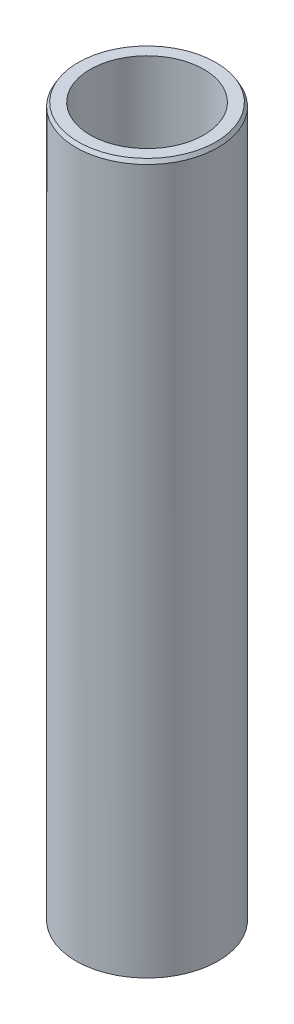
ISO-10303-21;
HEADER;
FILE_DESCRIPTION(('STEP AP214'),'2;1');
FILE_NAME('part.step','',(''),(''),'','','');
FILE_SCHEMA(('AUTOMOTIVE_DESIGN { 1 0 10303 214 1 1 1 1 }'));
ENDSEC;
DATA;
#1=APPLICATION_CONTEXT('core data for automotive mechanical design processes');
#2=APPLICATION_PROTOCOL_DEFINITION('international standard','automotive_design',2000,#1);
#3=PRODUCT_CONTEXT('',#1,'mechanical');
#4=PRODUCT('Part','Part','',(#3));
#5=PRODUCT_RELATED_PRODUCT_CATEGORY('part','',(#4));
#6=PRODUCT_DEFINITION_FORMATION('','',#4);
#7=PRODUCT_DEFINITION_CONTEXT('part definition',#1,'design');
#8=PRODUCT_DEFINITION('design','',#6,#7);
#9=PRODUCT_DEFINITION_SHAPE('','',#8);
#10=(LENGTH_UNIT() NAMED_UNIT(*) SI_UNIT(.MILLI.,.METRE.));
#11=(NAMED_UNIT(*) PLANE_ANGLE_UNIT() SI_UNIT($,.RADIAN.));
#12=(NAMED_UNIT(*) SI_UNIT($,.STERADIAN.) SOLID_ANGLE_UNIT());
#13=UNCERTAINTY_MEASURE_WITH_UNIT(LENGTH_MEASURE(1.E-05),#10,'distance_accuracy_value','');
#14=(GEOMETRIC_REPRESENTATION_CONTEXT(3) GLOBAL_UNCERTAINTY_ASSIGNED_CONTEXT((#13)) GLOBAL_UNIT_ASSIGNED_CONTEXT((#10,
#11,#12)) REPRESENTATION_CONTEXT('',''));
#15=CARTESIAN_POINT('',(0.,0.,0.));
#16=DIRECTION('',(0.,0.,1.));
#17=DIRECTION('',(1.,0.,0.));
#18=AXIS2_PLACEMENT_3D('',#15,#16,#17);
#19=CARTESIAN_POINT('',(0.,600.,0.));
#20=DIRECTION('',(0.,-1.,0.));
#21=DIRECTION('',(0.,0.,-1.));
#22=AXIS2_PLACEMENT_3D('',#19,#20,#21);
#23=CYLINDRICAL_SURFACE('',#22,60.);
#24=CARTESIAN_POINT('',(0.,596.803561940053,0.));
#25=DIRECTION('',(0.,1.,0.));
#26=DIRECTION('',(0.,0.,1.));
#27=AXIS2_PLACEMENT_3D('',#24,#25,#26);
#28=CIRCLE('',#27,60.);
#29=CARTESIAN_POINT('',(0.,596.803561940053,-60.));
#30=VERTEX_POINT('',#29);
#31=EDGE_CURVE('E50',#30,#30,#28,.F.);
#32=CARTESIAN_POINT('',(0.,1.84546437435817,0.));
#33=DIRECTION('',(0.,1.,0.));
#34=DIRECTION('',(0.,0.,1.));
#35=AXIS2_PLACEMENT_3D('',#32,#33,#34);
#36=CIRCLE('',#35,60.);
#37=CARTESIAN_POINT('',(0.,1.84546437435806,-60.));
#38=VERTEX_POINT('',#37);
#39=EDGE_CURVE('E51',#38,#38,#36,.T.);
#40=CARTESIAN_POINT('',(0.,596.803561940053,-60.));
#41=CARTESIAN_POINT('',(0.,590.606081757077,-60.));
#42=CARTESIAN_POINT('',(0.,584.408601574101,-60.));
#43=CARTESIAN_POINT('',(0.,572.013641208149,-60.));
#44=CARTESIAN_POINT('',(0.,565.816161025173,-60.));
#45=CARTESIAN_POINT('',(0.,553.421200659221,-60.));
#46=CARTESIAN_POINT('',(0.,547.223720476245,-60.));
#47=CARTESIAN_POINT('',(0.,534.828760110293,-60.));
#48=CARTESIAN_POINT('',(0.,528.631279927317,-60.));
#49=CARTESIAN_POINT('',(0.,516.236319561365,-60.));
#50=CARTESIAN_POINT('',(0.,510.038839378389,-60.));
#51=CARTESIAN_POINT('',(0.,497.643879012437,-60.));
#52=CARTESIAN_POINT('',(0.,491.446398829461,-60.));
#53=CARTESIAN_POINT('',(0.,479.051438463509,-60.));
#54=CARTESIAN_POINT('',(0.,472.853958280533,-60.));
#55=CARTESIAN_POINT('',(0.,460.458997914581,-60.));
#56=CARTESIAN_POINT('',(0.,454.261517731605,-60.));
#57=CARTESIAN_POINT('',(0.,441.866557365653,-60.));
#58=CARTESIAN_POINT('',(0.,435.669077182677,-60.));
#59=CARTESIAN_POINT('',(0.,423.274116816725,-60.));
#60=CARTESIAN_POINT('',(0.,417.076636633749,-60.));
#61=CARTESIAN_POINT('',(0.,404.681676267797,-60.));
#62=CARTESIAN_POINT('',(0.,398.484196084822,-60.));
#63=CARTESIAN_POINT('',(0.,386.089235718869,-60.));
#64=CARTESIAN_POINT('',(0.,379.891755535893,-60.));
#65=CARTESIAN_POINT('',(0.,367.496795169941,-60.));
#66=CARTESIAN_POINT('',(0.,361.299314986965,-60.));
#67=CARTESIAN_POINT('',(0.,348.904354621014,-60.));
#68=CARTESIAN_POINT('',(0.,342.706874438038,-60.));
#69=CARTESIAN_POINT('',(0.,330.311914072086,-60.));
#70=CARTESIAN_POINT('',(0.,324.11443388911,-60.));
#71=CARTESIAN_POINT('',(0.,311.719473523158,-60.));
#72=CARTESIAN_POINT('',(0.,305.521993340182,-60.));
#73=CARTESIAN_POINT('',(0.,293.12703297423,-60.));
#74=CARTESIAN_POINT('',(0.,286.929552791254,-60.));
#75=CARTESIAN_POINT('',(0.,274.534592425302,-60.));
#76=CARTESIAN_POINT('',(0.,268.337112242326,-60.));
#77=CARTESIAN_POINT('',(0.,255.942151876374,-60.));
#78=CARTESIAN_POINT('',(0.,249.744671693398,-60.));
#79=CARTESIAN_POINT('',(0.,237.349711327446,-60.));
#80=CARTESIAN_POINT('',(0.,231.15223114447,-60.));
#81=CARTESIAN_POINT('',(0.,218.757270778518,-60.));
#82=CARTESIAN_POINT('',(0.,212.559790595542,-60.));
#83=CARTESIAN_POINT('',(0.,200.16483022959,-60.));
#84=CARTESIAN_POINT('',(0.,193.967350046614,-60.));
#85=CARTESIAN_POINT('',(0.,181.572389680662,-60.));
#86=CARTESIAN_POINT('',(0.,175.374909497686,-60.));
#87=CARTESIAN_POINT('',(0.,162.979949131734,-60.));
#88=CARTESIAN_POINT('',(0.,156.782468948758,-60.));
#89=CARTESIAN_POINT('',(0.,144.387508582806,-60.));
#90=CARTESIAN_POINT('',(0.,138.19002839983,-60.));
#91=CARTESIAN_POINT('',(0.,125.795068033878,-60.));
#92=CARTESIAN_POINT('',(0.,119.597587850902,-60.));
#93=CARTESIAN_POINT('',(0.,107.20262748495,-60.));
#94=CARTESIAN_POINT('',(0.,101.005147301974,-60.));
#95=CARTESIAN_POINT('',(0.,88.6101869360218,-60.));
#96=CARTESIAN_POINT('',(0.,82.4127067530458,-60.));
#97=CARTESIAN_POINT('',(0.,70.0177463870939,-60.));
#98=CARTESIAN_POINT('',(0.,63.8202662041179,-60.));
#99=CARTESIAN_POINT('',(0.,51.4253058381659,-60.));
#100=CARTESIAN_POINT('',(0.,45.2278256551899,-60.));
#101=CARTESIAN_POINT('',(0.,32.832865289238,-60.));
#102=CARTESIAN_POINT('',(0.,26.635385106262,-60.));
#103=CARTESIAN_POINT('',(0.,14.24042474031,-60.));
#104=CARTESIAN_POINT('',(0.,8.04294455733404,-60.));
#105=CARTESIAN_POINT('',(0.,1.84546437435806,-60.));
#106=B_SPLINE_CURVE_WITH_KNOTS('',3,(#40,#41,#42,#43,#44,#45,#46,#47,#48,#49,#50,#51,#52,#53,
#54,#55,#56,#57,#58,#59,#60,#61,#62,#63,#64,#65,#66,#67,#68,#69,#70,#71,#72,#73,#74,#75,#76,#77,
#78,#79,#80,#81,#82,#83,#84,#85,#86,#87,#88,#89,#90,#91,#92,#93,#94,#95,#96,#97,#98,#99,#100,
#101,#102,#103,#104,#105),.UNSPECIFIED.,.F.,.F.,(4,2,2,2,2,2,2,2,2,2,2,2,2,2,2,2,2,2,2,2,2,2,2,
2,2,2,2,2,2,2,2,2,4),(0.,18.5924405489279,37.1848810978559,55.7773216467838,74.3697621957118,
92.9622027446398,111.554643293568,130.147083842496,148.739524391424,167.331964940352,
185.92440548928,204.516846038208,223.109286587136,241.701727136064,260.294167684992,
278.88660823392,297.479048782848,316.071489331775,334.663929880704,353.256370429631,
371.848810978559,390.441251527487,409.033692076415,427.626132625343,446.218573174271,
464.811013723199,483.403454272127,501.995894821055,520.588335369983,539.180775918911,
557.773216467839,576.365657016767,594.958097565695),.UNSPECIFIED.);
#107=EDGE_CURVE('BSEAM39',#30,#38,#106,.T.);
#108=ORIENTED_EDGE('',*,*,#31,.T.);
#109=ORIENTED_EDGE('',*,*,#39,.T.);
#110=ORIENTED_EDGE('',*,*,#107,.T.);
#111=ORIENTED_EDGE('',*,*,#107,.F.);
#112=EDGE_LOOP('',(#108,#110,#109,#111));
#113=FACE_BOUND('',#112,.T.);
#114=ADVANCED_FACE('F39',(#113),#23,.T.);
#115=CARTESIAN_POINT('',(0.,600.,0.));
#116=DIRECTION('',(0.,1.,0.));
#117=DIRECTION('',(0.,0.,1.));
#118=AXIS2_PLACEMENT_3D('',#115,#116,#117);
#119=PLANE('',#118);
#120=CARTESIAN_POINT('',(0.,600.,0.));
#121=DIRECTION('',(0.,1.,0.));
#122=DIRECTION('',(0.,0.,1.));
#123=AXIS2_PLACEMENT_3D('',#120,#121,#122);
#124=CIRCLE('',#123,58.1545356256418);
#125=CARTESIAN_POINT('',(0.,600.,-58.1545356256419));
#126=VERTEX_POINT('',#125);
#127=EDGE_CURVE('E54',#126,#126,#124,.T.);
#128=ORIENTED_EDGE('',*,*,#127,.T.);
#129=EDGE_LOOP('',(#128));
#130=FACE_BOUND('',#129,.T.);
#131=CARTESIAN_POINT('',(0.,600.,0.));
#132=DIRECTION('',(0.,1.,0.));
#133=DIRECTION('',(0.,0.,1.));
#134=AXIS2_PLACEMENT_3D('',#131,#132,#133);
#135=CIRCLE('',#134,48.027735614882);
#136=CARTESIAN_POINT('',(0.,600.,48.027735614882));
#137=VERTEX_POINT('',#136);
#138=EDGE_CURVE('E58',#137,#137,#135,.T.);
#139=ORIENTED_EDGE('',*,*,#138,.F.);
#140=EDGE_LOOP('',(#139));
#141=FACE_BOUND('',#140,.T.);
#142=ADVANCED_FACE('F69',(#130,#141),#119,.T.);
#143=CARTESIAN_POINT('',(0.,0.,0.));
#144=DIRECTION('',(0.,1.,0.));
#145=DIRECTION('',(0.,0.,1.));
#146=AXIS2_PLACEMENT_3D('',#143,#144,#145);
#147=PLANE('',#146);
#148=CARTESIAN_POINT('',(0.,0.,0.));
#149=DIRECTION('',(0.,1.,0.));
#150=DIRECTION('',(0.,0.,1.));
#151=AXIS2_PLACEMENT_3D('',#148,#149,#150);
#152=CIRCLE('',#151,56.8035619400534);
#153=CARTESIAN_POINT('',(0.,0.,56.8035619400534));
#154=VERTEX_POINT('',#153);
#155=EDGE_CURVE('E10',#154,#154,#152,.F.);
#156=ORIENTED_EDGE('',*,*,#155,.T.);
#157=EDGE_LOOP('',(#156));
#158=FACE_BOUND('',#157,.T.);
#159=CARTESIAN_POINT('',(0.,0.,0.));
#160=DIRECTION('',(0.,1.,0.));
#161=DIRECTION('',(0.,0.,1.));
#162=AXIS2_PLACEMENT_3D('',#159,#160,#161);
#163=CIRCLE('',#162,48.027735614882);
#164=CARTESIAN_POINT('',(0.,0.,48.027735614882));
#165=VERTEX_POINT('',#164);
#166=EDGE_CURVE('E63',#165,#165,#163,.T.);
#167=ORIENTED_EDGE('',*,*,#166,.T.);
#168=EDGE_LOOP('',(#167));
#169=FACE_BOUND('',#168,.T.);
#170=ADVANCED_FACE('F75',(#158,#169),#147,.F.);
#171=CARTESIAN_POINT('',(0.,600.,0.));
#172=DIRECTION('',(0.,-1.,0.));
#173=DIRECTION('',(0.,0.,-1.));
#174=AXIS2_PLACEMENT_3D('',#171,#172,#173);
#175=CYLINDRICAL_SURFACE('',#174,48.027735614882);
#176=ORIENTED_EDGE('',*,*,#138,.T.);
#177=EDGE_LOOP('',(#176));
#178=FACE_BOUND('',#177,.T.);
#179=ORIENTED_EDGE('',*,*,#166,.F.);
#180=EDGE_LOOP('',(#179));
#181=FACE_BOUND('',#180,.T.);
#182=ADVANCED_FACE('F70',(#178,#181),#175,.F.);
#183=CARTESIAN_POINT('',(0.,600.,0.));
#184=DIRECTION('',(0.,-1.,0.));
#185=DIRECTION('',(0.,0.,-1.));
#186=AXIS2_PLACEMENT_3D('',#183,#184,#185);
#187=CONICAL_SURFACE('',#186,58.1545356256418,0.52359877559829);
#188=CARTESIAN_POINT('',(0.,596.803561940053,-60.));
#189=CARTESIAN_POINT('',(0.,596.836858169844,-59.9807764127671));
#190=CARTESIAN_POINT('',(0.,596.870154399635,-59.9615528255342));
#191=CARTESIAN_POINT('',(0.,596.936746859218,-59.9231056510684));
#192=CARTESIAN_POINT('',(0.,596.970043089009,-59.9038820638356));
#193=CARTESIAN_POINT('',(0.,597.036635548591,-59.8654348893698));
#194=CARTESIAN_POINT('',(0.,597.069931778382,-59.8462113021368));
#195=CARTESIAN_POINT('',(0.,597.136524237964,-59.807764127671));
#196=CARTESIAN_POINT('',(0.,597.169820467755,-59.7885405404382));
#197=CARTESIAN_POINT('',(0.,597.236412927338,-59.7500933659724));
#198=CARTESIAN_POINT('',(0.,597.269709157129,-59.7308697787395));
#199=CARTESIAN_POINT('',(0.,597.336301616711,-59.6924226042737));
#200=CARTESIAN_POINT('',(0.,597.369597846502,-59.6731990170408));
#201=CARTESIAN_POINT('',(0.,597.436190306084,-59.634751842575));
#202=CARTESIAN_POINT('',(0.,597.469486535875,-59.6155282553421));
#203=CARTESIAN_POINT('',(0.,597.536078995458,-59.5770810808763));
#204=CARTESIAN_POINT('',(0.,597.569375225249,-59.5578574936434));
#205=CARTESIAN_POINT('',(0.,597.635967684831,-59.5194103191776));
#206=CARTESIAN_POINT('',(0.,597.669263914622,-59.5001867319447));
#207=CARTESIAN_POINT('',(0.,597.735856374204,-59.4617395574789));
#208=CARTESIAN_POINT('',(0.,597.769152603995,-59.442515970246));
#209=CARTESIAN_POINT('',(0.,597.835745063578,-59.4040687957802));
#210=CARTESIAN_POINT('',(0.,597.869041293369,-59.3848452085473));
#211=CARTESIAN_POINT('',(0.,597.935633752951,-59.3463980340815));
#212=CARTESIAN_POINT('',(0.,597.968929982742,-59.3271744468486));
#213=CARTESIAN_POINT('',(0.,598.035522442324,-59.2887272723828));
#214=CARTESIAN_POINT('',(0.,598.068818672116,-59.2695036851499));
#215=CARTESIAN_POINT('',(0.,598.135411131698,-59.2310565106841));
#216=CARTESIAN_POINT('',(0.,598.168707361489,-59.2118329234512));
#217=CARTESIAN_POINT('',(0.,598.235299821071,-59.1733857489854));
#218=CARTESIAN_POINT('',(0.,598.268596050862,-59.1541621617525));
#219=CARTESIAN_POINT('',(0.,598.335188510444,-59.1157149872867));
#220=CARTESIAN_POINT('',(0.,598.368484740236,-59.0964914000538));
#221=CARTESIAN_POINT('',(0.,598.435077199818,-59.0580442255881));
#222=CARTESIAN_POINT('',(0.,598.468373429609,-59.0388206383551));
#223=CARTESIAN_POINT('',(0.,598.534965889191,-59.0003734638893));
#224=CARTESIAN_POINT('',(0.,598.568262118982,-58.9811498766565));
#225=CARTESIAN_POINT('',(0.,598.634854578564,-58.9427027021907));
#226=CARTESIAN_POINT('',(0.,598.668150808355,-58.9234791149578));
#227=CARTESIAN_POINT('',(0.,598.734743267938,-58.885031940492));
#228=CARTESIAN_POINT('',(0.,598.768039497729,-58.8658083532591));
#229=CARTESIAN_POINT('',(0.,598.834631957311,-58.8273611787933));
#230=CARTESIAN_POINT('',(0.,598.867928187102,-58.8081375915604));
#231=CARTESIAN_POINT('',(0.,598.934520646684,-58.7696904170946));
#232=CARTESIAN_POINT('',(0.,598.967816876475,-58.7504668298617));
#233=CARTESIAN_POINT('',(0.,599.034409336058,-58.7120196553959));
#234=CARTESIAN_POINT('',(0.,599.067705565849,-58.692796068163));
#235=CARTESIAN_POINT('',(0.,599.134298025431,-58.6543488936972));
#236=CARTESIAN_POINT('',(0.,599.167594255222,-58.6351253064643));
#237=CARTESIAN_POINT('',(0.,599.234186714804,-58.5966781319985));
#238=CARTESIAN_POINT('',(0.,599.267482944595,-58.5774545447656));
#239=CARTESIAN_POINT('',(0.,599.334075404178,-58.5390073702998));
#240=CARTESIAN_POINT('',(0.,599.367371633969,-58.5197837830669));
#241=CARTESIAN_POINT('',(0.,599.433964093551,-58.4813366086011));
#242=CARTESIAN_POINT('',(0.,599.467260323342,-58.4621130213682));
#243=CARTESIAN_POINT('',(0.,599.533852782924,-58.4236658469024));
#244=CARTESIAN_POINT('',(0.,599.567149012716,-58.4044422596695));
#245=CARTESIAN_POINT('',(0.,599.633741472298,-58.3659950852037));
#246=CARTESIAN_POINT('',(0.,599.667037702089,-58.3467714979708));
#247=CARTESIAN_POINT('',(0.,599.733630161671,-58.308324323505));
#248=CARTESIAN_POINT('',(0.,599.766926391462,-58.2891007362721));
#249=CARTESIAN_POINT('',(0.,599.833518851044,-58.2506535618063));
#250=CARTESIAN_POINT('',(0.,599.866815080836,-58.2314299745734));
#251=CARTESIAN_POINT('',(0.,599.933407540418,-58.1929828001077));
#252=CARTESIAN_POINT('',(0.,599.966703770209,-58.1737592128748));
#253=CARTESIAN_POINT('',(0.,600.,-58.1545356256419));
#254=B_SPLINE_CURVE_WITH_KNOTS('',3,(#188,#189,#190,#191,#192,#193,#194,#195,#196,#197,#198,
#199,#200,#201,#202,#203,#204,#205,#206,#207,#208,#209,#210,#211,#212,#213,#214,#215,#216,#217,
#218,#219,#220,#221,#222,#223,#224,#225,#226,#227,#228,#229,#230,#231,#232,#233,#234,#235,#236,
#237,#238,#239,#240,#241,#242,#243,#244,#245,#246,#247,#248,#249,#250,#251,#252,#253),
.UNSPECIFIED.,.F.,.F.,(4,2,2,2,2,2,2,2,2,2,2,2,2,2,2,2,2,2,2,2,2,2,2,2,2,2,2,2,2,2,2,2,4),(0.,
0.115341523397334,0.230683046794764,0.346024570192097,0.461366093589527,0.576707616986861,
0.69204914038429,0.807390663781624,0.922732187179054,1.03807371057648,1.15341523397382,
1.26875675737125,1.38409828076858,1.49943980416601,1.61478132756334,1.73012285096077,
1.8454643743582,1.96080589775554,2.07614742115297,2.1914889445503,2.30683046794773,
2.42217199134507,2.53751351474249,2.65285503813983,2.76819656153726,2.88353808493469,
2.99887960833202,3.11422113172945,3.22956265512679,3.34490417852422,3.46024570192155,
3.57558722531898,3.69092874871641),.UNSPECIFIED.);
#255=EDGE_CURVE('BSEAM81',#30,#126,#254,.T.);
#256=ORIENTED_EDGE('',*,*,#31,.F.);
#257=ORIENTED_EDGE('',*,*,#127,.F.);
#258=ORIENTED_EDGE('',*,*,#255,.T.);
#259=ORIENTED_EDGE('',*,*,#255,.F.);
#260=EDGE_LOOP('',(#256,#258,#257,#259));
#261=FACE_BOUND('',#260,.T.);
#262=ADVANCED_FACE('F81',(#261),#187,.T.);
#263=CARTESIAN_POINT('',(0.,1.84546437435817,0.));
#264=DIRECTION('',(0.,1.,0.));
#265=DIRECTION('',(0.,0.,1.));
#266=AXIS2_PLACEMENT_3D('',#263,#264,#265);
#267=CONICAL_SURFACE('',#266,60.,1.04719755119659);
#268=ORIENTED_EDGE('',*,*,#155,.F.);
#269=EDGE_LOOP('',(#268));
#270=FACE_BOUND('',#269,.T.);
#271=ORIENTED_EDGE('',*,*,#39,.F.);
#272=EDGE_LOOP('',(#271));
#273=FACE_BOUND('',#272,.T.);
#274=ADVANCED_FACE('F45',(#270,#273),#267,.T.);
#275=CLOSED_SHELL('',(#114,#142,#170,#182,#262,#274));
#276=MANIFOLD_SOLID_BREP('B2',#275);
#277=ADVANCED_BREP_SHAPE_REPRESENTATION('',(#18,#276),#14);
#278=SHAPE_DEFINITION_REPRESENTATION(#9,#277);
ENDSEC;
END-ISO-10303-21;
